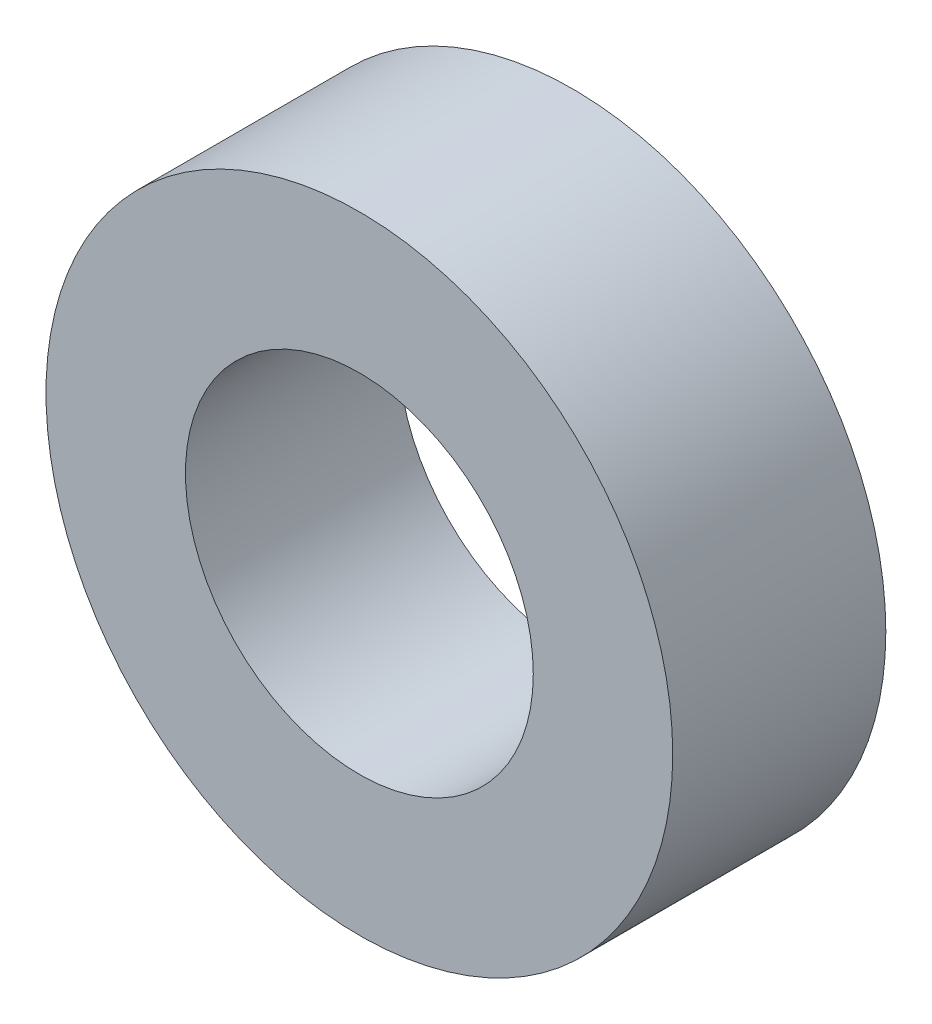
ISO-10303-21;
HEADER;
FILE_DESCRIPTION(('STEP AP214'),'2;1');
FILE_NAME('part.step','',(''),(''),'','','');
FILE_SCHEMA(('AUTOMOTIVE_DESIGN { 1 0 10303 214 1 1 1 1 }'));
ENDSEC;
DATA;
#1=APPLICATION_CONTEXT('core data for automotive mechanical design processes');
#2=APPLICATION_PROTOCOL_DEFINITION('international standard','automotive_design',2000,#1);
#3=PRODUCT_CONTEXT('',#1,'mechanical');
#4=PRODUCT('Part','Part','',(#3));
#5=PRODUCT_RELATED_PRODUCT_CATEGORY('part','',(#4));
#6=PRODUCT_DEFINITION_FORMATION('','',#4);
#7=PRODUCT_DEFINITION_CONTEXT('part definition',#1,'design');
#8=PRODUCT_DEFINITION('design','',#6,#7);
#9=PRODUCT_DEFINITION_SHAPE('','',#8);
#10=(LENGTH_UNIT() NAMED_UNIT(*) SI_UNIT(.MILLI.,.METRE.));
#11=(NAMED_UNIT(*) PLANE_ANGLE_UNIT() SI_UNIT($,.RADIAN.));
#12=(NAMED_UNIT(*) SI_UNIT($,.STERADIAN.) SOLID_ANGLE_UNIT());
#13=UNCERTAINTY_MEASURE_WITH_UNIT(LENGTH_MEASURE(1.E-05),#10,'distance_accuracy_value','');
#14=(GEOMETRIC_REPRESENTATION_CONTEXT(3) GLOBAL_UNCERTAINTY_ASSIGNED_CONTEXT((#13)) GLOBAL_UNIT_ASSIGNED_CONTEXT((#10,
#11,#12)) REPRESENTATION_CONTEXT('',''));
#15=CARTESIAN_POINT('',(0.,0.,0.));
#16=DIRECTION('',(0.,0.,1.));
#17=DIRECTION('',(1.,0.,0.));
#18=AXIS2_PLACEMENT_3D('',#15,#16,#17);
#19=CARTESIAN_POINT('',(0.,0.,6.8));
#20=DIRECTION('',(0.,0.,1.));
#21=DIRECTION('',(1.,0.,0.));
#22=AXIS2_PLACEMENT_3D('',#19,#20,#21);
#23=PLANE('',#22);
#24=CARTESIAN_POINT('',(0.,0.,6.8));
#25=DIRECTION('',(0.,0.,1.));
#26=DIRECTION('',(1.,0.,0.));
#27=AXIS2_PLACEMENT_3D('',#24,#25,#26);
#28=CIRCLE('',#27,10.);
#29=CARTESIAN_POINT('',(10.,0.,6.8));
#30=VERTEX_POINT('',#29);
#31=EDGE_CURVE('E10',#30,#30,#28,.T.);
#32=ORIENTED_EDGE('',*,*,#31,.T.);
#33=EDGE_LOOP('',(#32));
#34=FACE_BOUND('',#33,.T.);
#35=CARTESIAN_POINT('',(0.,0.,6.8));
#36=DIRECTION('',(0.,0.,1.));
#37=DIRECTION('',(1.,0.,0.));
#38=AXIS2_PLACEMENT_3D('',#35,#36,#37);
#39=CIRCLE('',#38,5.55);
#40=CARTESIAN_POINT('',(5.55,0.,6.8));
#41=VERTEX_POINT('',#40);
#42=EDGE_CURVE('E48',#41,#41,#39,.T.);
#43=ORIENTED_EDGE('',*,*,#42,.F.);
#44=EDGE_LOOP('',(#43));
#45=FACE_BOUND('',#44,.T.);
#46=ADVANCED_FACE('F34',(#34,#45),#23,.T.);
#47=CARTESIAN_POINT('',(0.,0.,0.));
#48=DIRECTION('',(0.,0.,1.));
#49=DIRECTION('',(1.,0.,0.));
#50=AXIS2_PLACEMENT_3D('',#47,#48,#49);
#51=PLANE('',#50);
#52=CARTESIAN_POINT('',(0.,0.,0.));
#53=DIRECTION('',(0.,0.,1.));
#54=DIRECTION('',(1.,0.,0.));
#55=AXIS2_PLACEMENT_3D('',#52,#53,#54);
#56=CIRCLE('',#55,10.);
#57=CARTESIAN_POINT('',(10.,0.,0.));
#58=VERTEX_POINT('',#57);
#59=EDGE_CURVE('E38',#58,#58,#56,.T.);
#60=ORIENTED_EDGE('',*,*,#59,.F.);
#61=EDGE_LOOP('',(#60));
#62=FACE_BOUND('',#61,.T.);
#63=CARTESIAN_POINT('',(0.,0.,0.));
#64=DIRECTION('',(0.,0.,1.));
#65=DIRECTION('',(1.,0.,0.));
#66=AXIS2_PLACEMENT_3D('',#63,#64,#65);
#67=CIRCLE('',#66,5.55);
#68=CARTESIAN_POINT('',(5.55,0.,0.));
#69=VERTEX_POINT('',#68);
#70=EDGE_CURVE('E50',#69,#69,#67,.T.);
#71=ORIENTED_EDGE('',*,*,#70,.T.);
#72=EDGE_LOOP('',(#71));
#73=FACE_BOUND('',#72,.T.);
#74=ADVANCED_FACE('F61',(#62,#73),#51,.F.);
#75=CARTESIAN_POINT('',(0.,0.,6.8));
#76=DIRECTION('',(0.,0.,-1.));
#77=DIRECTION('',(-1.,0.,0.));
#78=AXIS2_PLACEMENT_3D('',#75,#76,#77);
#79=CYLINDRICAL_SURFACE('',#78,10.);
#80=ORIENTED_EDGE('',*,*,#31,.F.);
#81=EDGE_LOOP('',(#80));
#82=FACE_BOUND('',#81,.T.);
#83=ORIENTED_EDGE('',*,*,#59,.T.);
#84=EDGE_LOOP('',(#83));
#85=FACE_BOUND('',#84,.T.);
#86=ADVANCED_FACE('F36',(#82,#85),#79,.T.);
#87=CARTESIAN_POINT('',(0.,0.,6.8));
#88=DIRECTION('',(0.,0.,-1.));
#89=DIRECTION('',(-1.,0.,0.));
#90=AXIS2_PLACEMENT_3D('',#87,#88,#89);
#91=CYLINDRICAL_SURFACE('',#90,5.55);
#92=ORIENTED_EDGE('',*,*,#42,.T.);
#93=EDGE_LOOP('',(#92));
#94=FACE_BOUND('',#93,.T.);
#95=ORIENTED_EDGE('',*,*,#70,.F.);
#96=EDGE_LOOP('',(#95));
#97=FACE_BOUND('',#96,.T.);
#98=ADVANCED_FACE('F57',(#94,#97),#91,.F.);
#99=CLOSED_SHELL('',(#46,#74,#86,#98));
#100=MANIFOLD_SOLID_BREP('B2',#99);
#101=ADVANCED_BREP_SHAPE_REPRESENTATION('',(#18,#100),#14);
#102=SHAPE_DEFINITION_REPRESENTATION(#9,#101);
ENDSEC;
END-ISO-10303-21;
